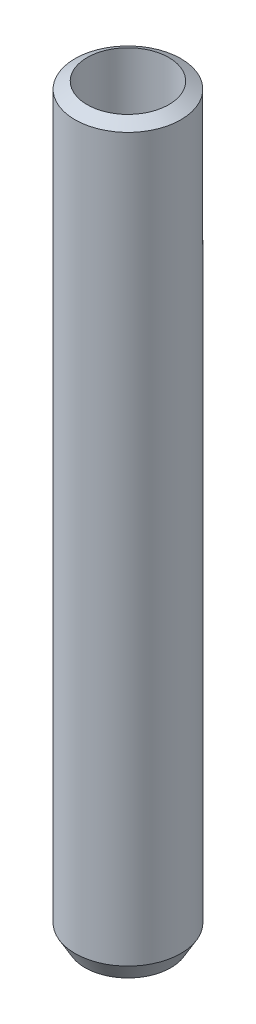
ISO-10303-21;
HEADER;
FILE_DESCRIPTION(('STEP AP214'),'2;1');
FILE_NAME('part.step','',(''),(''),'','','');
FILE_SCHEMA(('AUTOMOTIVE_DESIGN { 1 0 10303 214 1 1 1 1 }'));
ENDSEC;
DATA;
#1=APPLICATION_CONTEXT('core data for automotive mechanical design processes');
#2=APPLICATION_PROTOCOL_DEFINITION('international standard','automotive_design',2000,#1);
#3=PRODUCT_CONTEXT('',#1,'mechanical');
#4=PRODUCT('Part','Part','',(#3));
#5=PRODUCT_RELATED_PRODUCT_CATEGORY('part','',(#4));
#6=PRODUCT_DEFINITION_FORMATION('','',#4);
#7=PRODUCT_DEFINITION_CONTEXT('part definition',#1,'design');
#8=PRODUCT_DEFINITION('design','',#6,#7);
#9=PRODUCT_DEFINITION_SHAPE('','',#8);
#10=(LENGTH_UNIT() NAMED_UNIT(*) SI_UNIT(.MILLI.,.METRE.));
#11=(NAMED_UNIT(*) PLANE_ANGLE_UNIT() SI_UNIT($,.RADIAN.));
#12=(NAMED_UNIT(*) SI_UNIT($,.STERADIAN.) SOLID_ANGLE_UNIT());
#13=UNCERTAINTY_MEASURE_WITH_UNIT(LENGTH_MEASURE(1.E-05),#10,'distance_accuracy_value','');
#14=(GEOMETRIC_REPRESENTATION_CONTEXT(3) GLOBAL_UNCERTAINTY_ASSIGNED_CONTEXT((#13)) GLOBAL_UNIT_ASSIGNED_CONTEXT((#10,
#11,#12)) REPRESENTATION_CONTEXT('',''));
#15=CARTESIAN_POINT('',(0.,0.,0.));
#16=DIRECTION('',(0.,0.,1.));
#17=DIRECTION('',(1.,0.,0.));
#18=AXIS2_PLACEMENT_3D('',#15,#16,#17);
#19=CARTESIAN_POINT('',(0.,212.271156248155,0.));
#20=DIRECTION('',(0.,-1.,0.));
#21=DIRECTION('',(0.,0.,-1.));
#22=AXIS2_PLACEMENT_3D('',#19,#20,#21);
#23=CYLINDRICAL_SURFACE('',#22,15.);
#24=CARTESIAN_POINT('',(0.,209.427351103297,0.));
#25=DIRECTION('',(0.,1.,0.));
#26=DIRECTION('',(0.,0.,1.));
#27=AXIS2_PLACEMENT_3D('',#24,#25,#26);
#28=CIRCLE('',#27,15.);
#29=CARTESIAN_POINT('',(0.,209.427351103297,15.));
#30=VERTEX_POINT('',#29);
#31=EDGE_CURVE('E50',#30,#30,#28,.F.);
#32=ORIENTED_EDGE('',*,*,#31,.T.);
#33=EDGE_LOOP('',(#32));
#34=FACE_BOUND('',#33,.T.);
#35=CARTESIAN_POINT('',(0.,4.92561499772051,0.));
#36=DIRECTION('',(0.,1.,0.));
#37=DIRECTION('',(0.,0.,1.));
#38=AXIS2_PLACEMENT_3D('',#35,#36,#37);
#39=CIRCLE('',#38,15.);
#40=CARTESIAN_POINT('',(0.,4.92561499772051,15.));
#41=VERTEX_POINT('',#40);
#42=EDGE_CURVE('E51',#41,#41,#39,.T.);
#43=ORIENTED_EDGE('',*,*,#42,.T.);
#44=EDGE_LOOP('',(#43));
#45=FACE_BOUND('',#44,.T.);
#46=ADVANCED_FACE('F39',(#34,#45),#23,.T.);
#47=CARTESIAN_POINT('',(0.,0.,0.));
#48=DIRECTION('',(0.,1.,0.));
#49=DIRECTION('',(0.,0.,1.));
#50=AXIS2_PLACEMENT_3D('',#47,#48,#49);
#51=PLANE('',#50);
#52=CARTESIAN_POINT('',(0.,0.,0.));
#53=DIRECTION('',(0.,1.,0.));
#54=DIRECTION('',(0.,0.,1.));
#55=AXIS2_PLACEMENT_3D('',#52,#53,#54);
#56=CIRCLE('',#55,12.1561948551416);
#57=CARTESIAN_POINT('',(0.,0.,12.1561948551416));
#58=VERTEX_POINT('',#57);
#59=EDGE_CURVE('E10',#58,#58,#56,.F.);
#60=ORIENTED_EDGE('',*,*,#59,.T.);
#61=EDGE_LOOP('',(#60));
#62=FACE_BOUND('',#61,.T.);
#63=CARTESIAN_POINT('',(0.,0.,0.));
#64=DIRECTION('',(0.,1.,0.));
#65=DIRECTION('',(0.,0.,1.));
#66=AXIS2_PLACEMENT_3D('',#63,#64,#65);
#67=CIRCLE('',#66,11.5706306929805);
#68=CARTESIAN_POINT('',(0.,0.,11.5706306929805));
#69=VERTEX_POINT('',#68);
#70=EDGE_CURVE('E58',#69,#69,#67,.T.);
#71=ORIENTED_EDGE('',*,*,#70,.T.);
#72=EDGE_LOOP('',(#71));
#73=FACE_BOUND('',#72,.T.);
#74=ADVANCED_FACE('F62',(#62,#73),#51,.F.);
#75=CARTESIAN_POINT('',(0.,212.271156248155,0.));
#76=DIRECTION('',(0.,-1.,0.));
#77=DIRECTION('',(0.,0.,-1.));
#78=AXIS2_PLACEMENT_3D('',#75,#76,#77);
#79=CYLINDRICAL_SURFACE('',#78,11.5706306929805);
#80=CARTESIAN_POINT('',(0.,211.407298395855,0.));
#81=DIRECTION('',(0.,-1.,0.));
#82=DIRECTION('',(0.,0.,-1.));
#83=AXIS2_PLACEMENT_3D('',#80,#81,#82);
#84=CIRCLE('',#83,11.5706306929805);
#85=CARTESIAN_POINT('',(0.,211.407298395855,-11.5706306929805));
#86=VERTEX_POINT('',#85);
#87=EDGE_CURVE('E54',#86,#86,#84,.F.);
#88=ORIENTED_EDGE('',*,*,#87,.T.);
#89=EDGE_LOOP('',(#88));
#90=FACE_BOUND('',#89,.T.);
#91=ORIENTED_EDGE('',*,*,#70,.F.);
#92=EDGE_LOOP('',(#91));
#93=FACE_BOUND('',#92,.T.);
#94=ADVANCED_FACE('F68',(#90,#93),#79,.F.);
#95=CARTESIAN_POINT('',(0.,212.271156248155,0.));
#96=DIRECTION('',(0.,-1.,0.));
#97=DIRECTION('',(0.,0.,-1.));
#98=AXIS2_PLACEMENT_3D('',#95,#96,#97);
#99=CONICAL_SURFACE('',#98,10.0743850022793,1.0471975511966);
#100=ORIENTED_EDGE('',*,*,#31,.F.);
#101=EDGE_LOOP('',(#100));
#102=FACE_BOUND('',#101,.T.);
#103=ORIENTED_EDGE('',*,*,#87,.F.);
#104=EDGE_LOOP('',(#103));
#105=FACE_BOUND('',#104,.T.);
#106=ADVANCED_FACE('F66',(#102,#105),#99,.T.);
#107=CARTESIAN_POINT('',(0.,4.92561499772051,0.));
#108=DIRECTION('',(0.,1.,0.));
#109=DIRECTION('',(0.,0.,1.));
#110=AXIS2_PLACEMENT_3D('',#107,#108,#109);
#111=CONICAL_SURFACE('',#110,15.,0.523598775598303);
#112=CARTESIAN_POINT('',(0.,0.,12.1561948551416));
#113=CARTESIAN_POINT('',(0.,0.0513084895595877,12.1858178254005));
#114=CARTESIAN_POINT('',(0.,0.102616979119176,12.2154407956595));
#115=CARTESIAN_POINT('',(0.,0.205233958238354,12.2746867361773));
#116=CARTESIAN_POINT('',(0.,0.256542447797942,12.3043097064363));
#117=CARTESIAN_POINT('',(0.,0.35915942691712,12.3635556469542));
#118=CARTESIAN_POINT('',(0.,0.410467916476708,12.3931786172131));
#119=CARTESIAN_POINT('',(0.,0.513084895595886,12.452424557731));
#120=CARTESIAN_POINT('',(0.,0.564393385155475,12.4820475279899));
#121=CARTESIAN_POINT('',(0.,0.667010364274652,12.5412934685078));
#122=CARTESIAN_POINT('',(0.,0.718318853834241,12.5709164387668));
#123=CARTESIAN_POINT('',(0.,0.820935832953418,12.6301623792846));
#124=CARTESIAN_POINT('',(0.,0.872244322513006,12.6597853495436));
#125=CARTESIAN_POINT('',(0.,0.974861301632184,12.7190312900615));
#126=CARTESIAN_POINT('',(0.,1.02616979119177,12.7486542603204));
#127=CARTESIAN_POINT('',(0.,1.12878677031095,12.8079002008383));
#128=CARTESIAN_POINT('',(0.,1.18009525987054,12.8375231710972));
#129=CARTESIAN_POINT('',(0.,1.28271223898972,12.8967691116151));
#130=CARTESIAN_POINT('',(0.,1.3340207285493,12.9263920818741));
#131=CARTESIAN_POINT('',(0.,1.43663770766848,12.9856380223919));
#132=CARTESIAN_POINT('',(0.,1.48794619722807,13.0152609926509));
#133=CARTESIAN_POINT('',(0.,1.59056317634725,13.0745069331688));
#134=CARTESIAN_POINT('',(0.,1.64187166590684,13.1041299034277));
#135=CARTESIAN_POINT('',(0.,1.74448864502601,13.1633758439456));
#136=CARTESIAN_POINT('',(0.,1.7957971345856,13.1929988142045));
#137=CARTESIAN_POINT('',(0.,1.89841411370478,13.2522447547224));
#138=CARTESIAN_POINT('',(0.,1.94972260326437,13.2818677249814));
#139=CARTESIAN_POINT('',(0.,2.05233958238355,13.3411136654993));
#140=CARTESIAN_POINT('',(0.,2.10364807194313,13.3707366357582));
#141=CARTESIAN_POINT('',(0.,2.20626505106231,13.4299825762761));
#142=CARTESIAN_POINT('',(0.,2.2575735406219,13.459605546535));
#143=CARTESIAN_POINT('',(0.,2.36019051974108,13.5188514870529));
#144=CARTESIAN_POINT('',(0.,2.41149900930067,13.5484744573118));
#145=CARTESIAN_POINT('',(0.,2.51411598841984,13.6077203978297));
#146=CARTESIAN_POINT('',(0.,2.56542447797943,13.6373433680887));
#147=CARTESIAN_POINT('',(0.,2.66804145709861,13.6965893086066));
#148=CARTESIAN_POINT('',(0.,2.7193499466582,13.7262122788655));
#149=CARTESIAN_POINT('',(0.,2.82196692577738,13.7854582193834));
#150=CARTESIAN_POINT('',(0.,2.87327541533696,13.8150811896423));
#151=CARTESIAN_POINT('',(0.,2.97589239445614,13.8743271301602));
#152=CARTESIAN_POINT('',(0.,3.02720088401573,13.9039501004191));
#153=CARTESIAN_POINT('',(0.,3.12981786313491,13.963196040937));
#154=CARTESIAN_POINT('',(0.,3.1811263526945,13.992819011196));
#155=CARTESIAN_POINT('',(0.,3.28374333181367,14.0520649517139));
#156=CARTESIAN_POINT('',(0.,3.33505182137326,14.0816879219728));
#157=CARTESIAN_POINT('',(0.,3.43766880049244,14.1409338624907));
#158=CARTESIAN_POINT('',(0.,3.48897729005203,14.1705568327496));
#159=CARTESIAN_POINT('',(0.,3.59159426917121,14.2298027732675));
#160=CARTESIAN_POINT('',(0.,3.64290275873079,14.2594257435265));
#161=CARTESIAN_POINT('',(0.,3.74551973784997,14.3186716840443));
#162=CARTESIAN_POINT('',(0.,3.79682822740956,14.3482946543033));
#163=CARTESIAN_POINT('',(0.,3.89944520652874,14.4075405948212));
#164=CARTESIAN_POINT('',(0.,3.95075369608833,14.4371635650801));
#165=CARTESIAN_POINT('',(0.,4.0533706752075,14.496409505598));
#166=CARTESIAN_POINT('',(0.,4.10467916476709,14.5260324758569));
#167=CARTESIAN_POINT('',(0.,4.20729614388627,14.5852784163748));
#168=CARTESIAN_POINT('',(0.,4.25860463344586,14.6149013866338));
#169=CARTESIAN_POINT('',(0.,4.36122161256504,14.6741473271516));
#170=CARTESIAN_POINT('',(0.,4.41253010212462,14.7037702974106));
#171=CARTESIAN_POINT('',(0.,4.5151470812438,14.7630162379285));
#172=CARTESIAN_POINT('',(0.,4.56645557080339,14.7926392081874));
#173=CARTESIAN_POINT('',(0.,4.66907254992257,14.8518851487053));
#174=CARTESIAN_POINT('',(0.,4.72038103948216,14.8815081189642));
#175=CARTESIAN_POINT('',(0.,4.82299801860133,14.9407540594821));
#176=CARTESIAN_POINT('',(0.,4.87430650816092,14.9703770297411));
#177=CARTESIAN_POINT('',(0.,4.92561499772051,15.));
#178=B_SPLINE_CURVE_WITH_KNOTS('',3,(#112,#113,#114,#115,#116,#117,#118,#119,#120,#121,#122,
#123,#124,#125,#126,#127,#128,#129,#130,#131,#132,#133,#134,#135,#136,#137,#138,#139,#140,#141,
#142,#143,#144,#145,#146,#147,#148,#149,#150,#151,#152,#153,#154,#155,#156,#157,#158,#159,#160,
#161,#162,#163,#164,#165,#166,#167,#168,#169,#170,#171,#172,#173,#174,#175,#176,#177),
.UNSPECIFIED.,.F.,.F.,(4,2,2,2,2,2,2,2,2,2,2,2,2,2,2,2,2,2,2,2,2,2,2,2,2,2,2,2,2,2,2,2,4),(0.,
0.17773782155365,0.355475643107301,0.533213464660951,0.7109512862146,0.888689107768251,
1.0664269293219,1.24416475087555,1.4219025724292,1.59964039398285,1.7773782155365,
1.95511603709015,2.1328538586438,2.31059168019745,2.4883295017511,2.66606732330475,
2.8438051448584,3.02154296641205,3.1992807879657,3.37701860951935,3.554756431073,
3.73249425262665,3.9102320741803,4.08796989573396,4.26570771728761,4.44344553884126,
4.62118336039491,4.79892118194856,4.97665900350221,5.15439682505586,5.33213464660951,
5.50987246816316,5.68761028971681),.UNSPECIFIED.);
#179=EDGE_CURVE('BSEAM45',#58,#41,#178,.T.);
#180=ORIENTED_EDGE('',*,*,#59,.F.);
#181=ORIENTED_EDGE('',*,*,#42,.F.);
#182=ORIENTED_EDGE('',*,*,#179,.T.);
#183=ORIENTED_EDGE('',*,*,#179,.F.);
#184=EDGE_LOOP('',(#180,#182,#181,#183));
#185=FACE_BOUND('',#184,.T.);
#186=ADVANCED_FACE('F45',(#185),#111,.T.);
#187=CLOSED_SHELL('',(#46,#74,#94,#106,#186));
#188=MANIFOLD_SOLID_BREP('B2',#187);
#189=ADVANCED_BREP_SHAPE_REPRESENTATION('',(#18,#188),#14);
#190=SHAPE_DEFINITION_REPRESENTATION(#9,#189);
ENDSEC;
END-ISO-10303-21;
